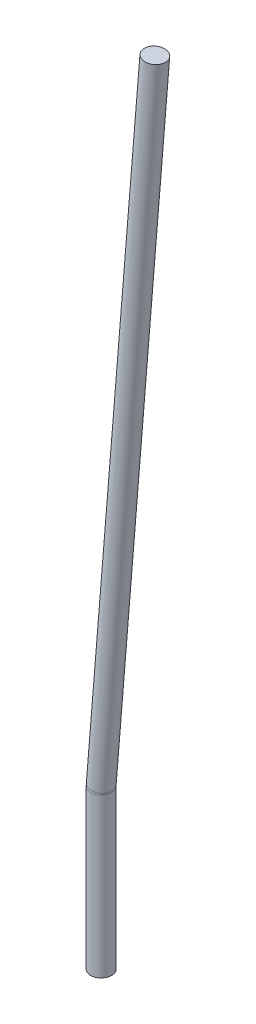
ISO-10303-21;
HEADER;
FILE_DESCRIPTION(('STEP AP214'),'2;1');
FILE_NAME('part.step','',(''),(''),'','','');
FILE_SCHEMA(('AUTOMOTIVE_DESIGN { 1 0 10303 214 1 1 1 1 }'));
ENDSEC;
DATA;
#1=APPLICATION_CONTEXT('core data for automotive mechanical design processes');
#2=APPLICATION_PROTOCOL_DEFINITION('international standard','automotive_design',2000,#1);
#3=PRODUCT_CONTEXT('',#1,'mechanical');
#4=PRODUCT('Part','Part','',(#3));
#5=PRODUCT_RELATED_PRODUCT_CATEGORY('part','',(#4));
#6=PRODUCT_DEFINITION_FORMATION('','',#4);
#7=PRODUCT_DEFINITION_CONTEXT('part definition',#1,'design');
#8=PRODUCT_DEFINITION('design','',#6,#7);
#9=PRODUCT_DEFINITION_SHAPE('','',#8);
#10=(LENGTH_UNIT() NAMED_UNIT(*) SI_UNIT(.MILLI.,.METRE.));
#11=(NAMED_UNIT(*) PLANE_ANGLE_UNIT() SI_UNIT($,.RADIAN.));
#12=(NAMED_UNIT(*) SI_UNIT($,.STERADIAN.) SOLID_ANGLE_UNIT());
#13=UNCERTAINTY_MEASURE_WITH_UNIT(LENGTH_MEASURE(1.E-05),#10,'distance_accuracy_value','');
#14=(GEOMETRIC_REPRESENTATION_CONTEXT(3) GLOBAL_UNCERTAINTY_ASSIGNED_CONTEXT((#13)) GLOBAL_UNIT_ASSIGNED_CONTEXT((#10,
#11,#12)) REPRESENTATION_CONTEXT('',''));
#15=CARTESIAN_POINT('',(0.,0.,0.));
#16=DIRECTION('',(0.,0.,1.));
#17=DIRECTION('',(1.,0.,0.));
#18=AXIS2_PLACEMENT_3D('',#15,#16,#17);
#19=CARTESIAN_POINT('',(0.,-3.,0.));
#20=DIRECTION('',(0.,1.,0.));
#21=DIRECTION('',(0.,0.,1.));
#22=AXIS2_PLACEMENT_3D('',#19,#20,#21);
#23=CYLINDRICAL_SURFACE('',#22,0.2);
#24=CARTESIAN_POINT('',(0.,-3.,0.));
#25=DIRECTION('',(0.,1.,0.));
#26=DIRECTION('',(0.,0.,1.));
#27=AXIS2_PLACEMENT_3D('',#24,#25,#26);
#28=CIRCLE('',#27,0.2);
#29=CARTESIAN_POINT('',(0.,-3.,0.2));
#30=VERTEX_POINT('',#29);
#31=EDGE_CURVE('E10',#30,#30,#28,.T.);
#32=ORIENTED_EDGE('',*,*,#31,.T.);
#33=EDGE_LOOP('',(#32));
#34=FACE_BOUND('',#33,.T.);
#35=CARTESIAN_POINT('',(0.,0.,0.));
#36=DIRECTION('',(0.,1.,0.));
#37=DIRECTION('',(0.,0.,1.));
#38=AXIS2_PLACEMENT_3D('',#35,#36,#37);
#39=CIRCLE('',#38,0.2);
#40=CARTESIAN_POINT('',(-0.2,0.,0.));
#41=VERTEX_POINT('',#40);
#42=EDGE_CURVE('E40',#41,#41,#39,.T.);
#43=ORIENTED_EDGE('',*,*,#42,.F.);
#44=EDGE_LOOP('',(#43));
#45=FACE_BOUND('',#44,.T.);
#46=ADVANCED_FACE('F37',(#34,#45),#23,.T.);
#47=CARTESIAN_POINT('',(0.,-3.,0.));
#48=DIRECTION('',(0.,1.,0.));
#49=DIRECTION('',(0.,0.,1.));
#50=AXIS2_PLACEMENT_3D('',#47,#48,#49);
#51=PLANE('',#50);
#52=ORIENTED_EDGE('',*,*,#31,.F.);
#53=EDGE_LOOP('',(#52));
#54=FACE_BOUND('',#53,.T.);
#55=ADVANCED_FACE('F70',(#54),#51,.F.);
#56=CARTESIAN_POINT('',(0.5,0.,0.));
#57=DIRECTION('',(0.,0.,1.));
#58=DIRECTION('',(1.,0.,0.));
#59=AXIS2_PLACEMENT_3D('',#56,#57,#58);
#60=TOROIDAL_SURFACE('',#59,0.5,0.2);
#61=CARTESIAN_POINT('',(0.0016528260953485,0.0406213522823529,0.));
#62=DIRECTION('',(0.0812427045647058,0.996694347809303,0.));
#63=DIRECTION('',(0.,0.,1.));
#64=AXIS2_PLACEMENT_3D('',#61,#62,#63);
#65=CIRCLE('',#64,0.2);
#66=CARTESIAN_POINT('',(-0.197686043466512,0.0568698931952941,0.));
#67=VERTEX_POINT('',#66);
#68=EDGE_CURVE('E49',#67,#67,#65,.T.);
#69=CARTESIAN_POINT('',(0.5,0.,0.));
#70=DIRECTION('',(0.,0.,1.));
#71=DIRECTION('',(1.,0.,0.));
#72=AXIS2_PLACEMENT_3D('',#69,#70,#71);
#73=CIRCLE('',#72,0.7);
#74=EDGE_CURVE('',#67,#41,#73,.T.);
#75=ORIENTED_EDGE('',*,*,#68,.F.);
#76=ORIENTED_EDGE('',*,*,#42,.T.);
#77=ORIENTED_EDGE('',*,*,#74,.T.);
#78=ORIENTED_EDGE('',*,*,#74,.F.);
#79=EDGE_LOOP('',(#75,#77,#76,#78));
#80=FACE_BOUND('',#79,.T.);
#81=ADVANCED_FACE('F64',(#80),#60,.T.);
#82=CARTESIAN_POINT('',(1.01718663315417,12.4993006998986,0.));
#83=DIRECTION('',(-0.0812427045647059,-0.996694347809303,0.));
#84=DIRECTION('',(0.996694347809303,-0.0812427045647059,0.));
#85=AXIS2_PLACEMENT_3D('',#82,#83,#84);
#86=CYLINDRICAL_SURFACE('',#85,0.2);
#87=CARTESIAN_POINT('',(1.01718663315417,12.4993006998986,0.));
#88=DIRECTION('',(0.0812427045647059,0.996694347809303,0.));
#89=DIRECTION('',(-0.996694347809303,0.0812427045647059,0.));
#90=AXIS2_PLACEMENT_3D('',#87,#88,#89);
#91=CIRCLE('',#90,0.2);
#92=CARTESIAN_POINT('',(0.817847763592311,12.5155492408116,0.));
#93=VERTEX_POINT('',#92);
#94=EDGE_CURVE('E54',#93,#93,#91,.T.);
#95=ORIENTED_EDGE('',*,*,#94,.F.);
#96=EDGE_LOOP('',(#95));
#97=FACE_BOUND('',#96,.T.);
#98=ORIENTED_EDGE('',*,*,#68,.T.);
#99=EDGE_LOOP('',(#98));
#100=FACE_BOUND('',#99,.T.);
#101=ADVANCED_FACE('F61',(#97,#100),#86,.T.);
#102=CARTESIAN_POINT('',(1.01718663315417,12.4993006998986,0.));
#103=DIRECTION('',(0.0812427045647059,0.996694347809303,0.));
#104=DIRECTION('',(-0.996694347809303,0.0812427045647059,0.));
#105=AXIS2_PLACEMENT_3D('',#102,#103,#104);
#106=PLANE('',#105);
#107=ORIENTED_EDGE('',*,*,#94,.T.);
#108=EDGE_LOOP('',(#107));
#109=FACE_BOUND('',#108,.T.);
#110=ADVANCED_FACE('F59',(#109),#106,.T.);
#111=CLOSED_SHELL('',(#46,#55,#81,#101,#110));
#112=MANIFOLD_SOLID_BREP('B2',#111);
#113=ADVANCED_BREP_SHAPE_REPRESENTATION('',(#18,#112),#14);
#114=SHAPE_DEFINITION_REPRESENTATION(#9,#113);
ENDSEC;
END-ISO-10303-21;
